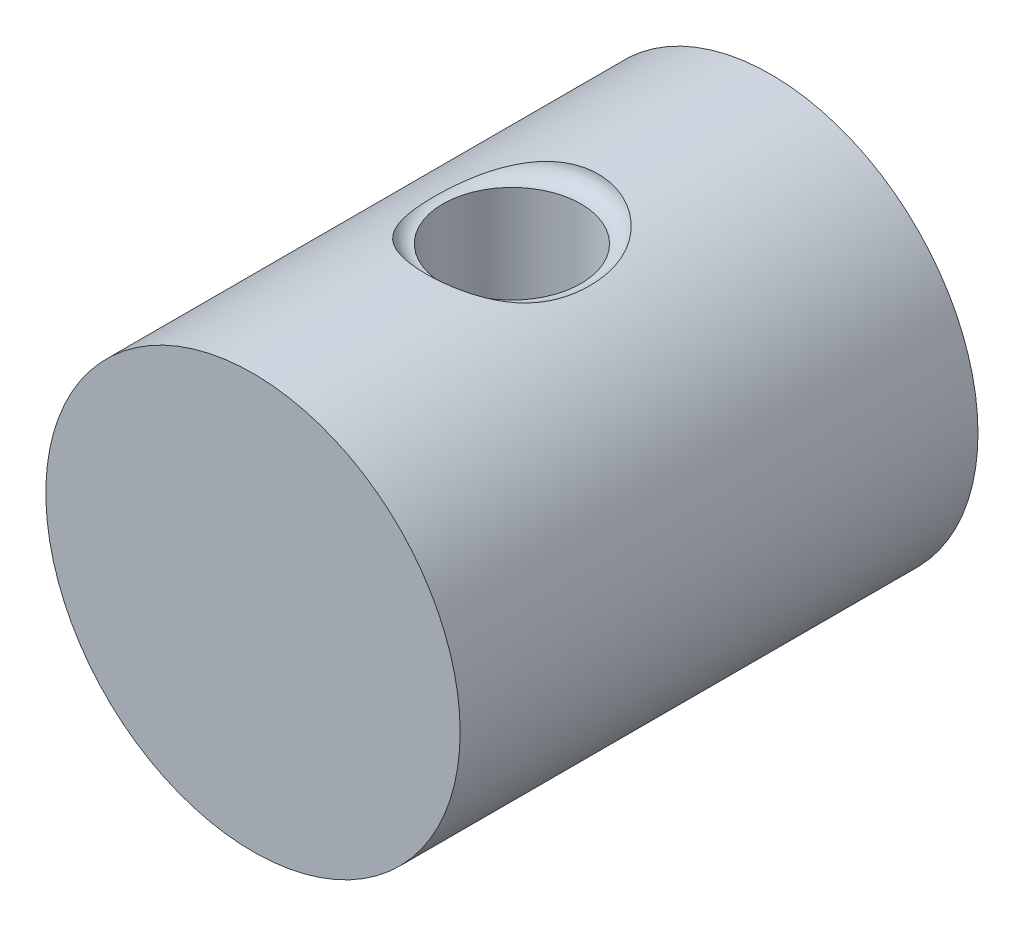
ISO-10303-21;
HEADER;
FILE_DESCRIPTION(('STEP AP214'),'2;1');
FILE_NAME('part.step','',(''),(''),'','','');
FILE_SCHEMA(('AUTOMOTIVE_DESIGN { 1 0 10303 214 1 1 1 1 }'));
ENDSEC;
DATA;
#1=APPLICATION_CONTEXT('core data for automotive mechanical design processes');
#2=APPLICATION_PROTOCOL_DEFINITION('international standard','automotive_design',2000,#1);
#3=PRODUCT_CONTEXT('',#1,'mechanical');
#4=PRODUCT('Part','Part','',(#3));
#5=PRODUCT_RELATED_PRODUCT_CATEGORY('part','',(#4));
#6=PRODUCT_DEFINITION_FORMATION('','',#4);
#7=PRODUCT_DEFINITION_CONTEXT('part definition',#1,'design');
#8=PRODUCT_DEFINITION('design','',#6,#7);
#9=PRODUCT_DEFINITION_SHAPE('','',#8);
#10=(LENGTH_UNIT() NAMED_UNIT(*) SI_UNIT(.MILLI.,.METRE.));
#11=(NAMED_UNIT(*) PLANE_ANGLE_UNIT() SI_UNIT($,.RADIAN.));
#12=(NAMED_UNIT(*) SI_UNIT($,.STERADIAN.) SOLID_ANGLE_UNIT());
#13=UNCERTAINTY_MEASURE_WITH_UNIT(LENGTH_MEASURE(1.E-05),#10,'distance_accuracy_value','');
#14=(GEOMETRIC_REPRESENTATION_CONTEXT(3) GLOBAL_UNCERTAINTY_ASSIGNED_CONTEXT((#13)) GLOBAL_UNIT_ASSIGNED_CONTEXT((#10,
#11,#12)) REPRESENTATION_CONTEXT('',''));
#15=CARTESIAN_POINT('',(0.,0.,0.));
#16=DIRECTION('',(0.,0.,1.));
#17=DIRECTION('',(1.,0.,0.));
#18=AXIS2_PLACEMENT_3D('',#15,#16,#17);
#19=CARTESIAN_POINT('',(0.,0.,15.));
#20=DIRECTION('',(0.,0.,-1.));
#21=DIRECTION('',(-1.,0.,0.));
#22=AXIS2_PLACEMENT_3D('',#19,#20,#21);
#23=CYLINDRICAL_SURFACE('',#22,12.);
#24=CARTESIAN_POINT('',(0.,0.,-15.));
#25=DIRECTION('',(0.,0.,1.));
#26=DIRECTION('',(1.,0.,0.));
#27=AXIS2_PLACEMENT_3D('',#24,#25,#26);
#28=CIRCLE('',#27,12.);
#29=CARTESIAN_POINT('',(12.,0.,-15.));
#30=VERTEX_POINT('',#29);
#31=EDGE_CURVE('E42',#30,#30,#28,.T.);
#32=ORIENTED_EDGE('',*,*,#31,.T.);
#33=EDGE_LOOP('',(#32));
#34=FACE_BOUND('',#33,.T.);
#35=CARTESIAN_POINT('',(0.,0.,15.));
#36=DIRECTION('',(0.,0.,1.));
#37=DIRECTION('',(1.,0.,0.));
#38=AXIS2_PLACEMENT_3D('',#35,#36,#37);
#39=CIRCLE('',#38,12.);
#40=CARTESIAN_POINT('',(12.,0.,15.));
#41=VERTEX_POINT('',#40);
#42=EDGE_CURVE('E38',#41,#41,#39,.T.);
#43=ORIENTED_EDGE('',*,*,#42,.F.);
#44=EDGE_LOOP('',(#43));
#45=FACE_BOUND('',#44,.T.);
#46=CARTESIAN_POINT('',(0.,-12.,3.99999999999999));
#47=CARTESIAN_POINT('',(0.218253451546892,-12.0000006120378,4.00000101492655));
#48=CARTESIAN_POINT('',(0.436500778154198,-11.9939907803018,3.98207893549112));
#49=CARTESIAN_POINT('',(0.866567043491887,-11.9706084081312,3.91108356473112));
#50=CARTESIAN_POINT('',(1.07838531247527,-11.9532346880861,3.8580066242043));
#51=CARTESIAN_POINT('',(1.4893311580071,-11.9090123162577,3.7187230264638));
#52=CARTESIAN_POINT('',(1.68847930354413,-11.8821795092341,3.6325717501629));
#53=CARTESIAN_POINT('',(2.0694997472213,-11.8217778286937,3.42983530864661));
#54=CARTESIAN_POINT('',(2.25136862783482,-11.7882076267112,3.3132441399896));
#55=CARTESIAN_POINT('',(2.59896670008906,-11.7165637777201,3.04869678056497));
#56=CARTESIAN_POINT('',(2.76401480119322,-11.6783822585509,2.89987506295799));
#57=CARTESIAN_POINT('',(3.06733077080835,-11.6024125913254,2.57693138117376));
#58=CARTESIAN_POINT('',(3.2055927419579,-11.5646245316238,2.40280386028606));
#59=CARTESIAN_POINT('',(3.45529976891137,-11.4925332990891,2.02805953921404));
#60=CARTESIAN_POINT('',(3.56585943288389,-11.4583615710204,1.82682504107105));
#61=CARTESIAN_POINT('',(3.75127549551111,-11.3990122167512,1.40729562216627));
#62=CARTESIAN_POINT('',(3.82614278954792,-11.3738318464566,1.18900593135073));
#63=CARTESIAN_POINT('',(3.9354938460358,-11.3364521307493,0.749307114011505));
#64=CARTESIAN_POINT('',(3.97125379308398,-11.3238438306895,0.528251166037676));
#65=CARTESIAN_POINT('',(4.00536449334099,-11.3118262652752,0.082944983382537));
#66=CARTESIAN_POINT('',(4.00372680643039,-11.312412921263,-0.14130424281417));
#67=CARTESIAN_POINT('',(3.96407961480176,-11.3263605999899,-0.575746521807553));
#68=CARTESIAN_POINT('',(3.92773565262441,-11.3391366334693,-0.786113611774476));
#69=CARTESIAN_POINT('',(3.82242465135522,-11.3750663077523,-1.19757367852082));
#70=CARTESIAN_POINT('',(3.75345370635798,-11.3982211910317,-1.39866554176195));
#71=CARTESIAN_POINT('',(3.58375623225406,-11.4527164455868,-1.78965099833565));
#72=CARTESIAN_POINT('',(3.48253619483259,-11.4841826318151,-1.97931210186998));
#73=CARTESIAN_POINT('',(3.251556425209,-11.5517023429386,-2.33948363312703));
#74=CARTESIAN_POINT('',(3.12178844945504,-11.5877571915937,-2.50998850773575));
#75=CARTESIAN_POINT('',(2.82939733072997,-11.6626931667357,-2.83636639264074));
#76=CARTESIAN_POINT('',(2.66541260030551,-11.7016235742007,-2.99101077803564));
#77=CARTESIAN_POINT('',(2.31335827987998,-11.7762775354745,-3.27092506665421));
#78=CARTESIAN_POINT('',(2.12528638264318,-11.8120007815208,-3.39619215265814));
#79=CARTESIAN_POINT('',(1.72779045218514,-11.8766843175137,-3.6147852009401));
#80=CARTESIAN_POINT('',(1.51817310566536,-11.9055740003221,-3.70778196536287));
#81=CARTESIAN_POINT('',(1.08507633345801,-11.9528226857769,-3.85681269582288));
#82=CARTESIAN_POINT('',(0.861601752619807,-11.971185346195,-3.91285950169375));
#83=CARTESIAN_POINT('',(0.41753531811722,-11.9947050828577,-3.98422266408941));
#84=CARTESIAN_POINT('',(0.197238399459386,-12.0004000733492,-4.00119923669099));
#85=CARTESIAN_POINT('',(-0.24310027984095,-11.9995561077931,-3.99866930560612));
#86=CARTESIAN_POINT('',(-0.463142077278601,-11.9930192167745,-3.97916896008049));
#87=CARTESIAN_POINT('',(-0.89007946521702,-11.9688009886842,-3.90555236905616));
#88=CARTESIAN_POINT('',(-1.09717122733937,-11.9514479484477,-3.85245517580201));
#89=CARTESIAN_POINT('',(-1.49942383431829,-11.9076738732028,-3.71442622213308));
#90=CARTESIAN_POINT('',(-1.69458315403442,-11.881251681867,-3.62949040212885));
#91=CARTESIAN_POINT('',(-2.07315318557309,-11.8211572514916,-3.42771827263685));
#92=CARTESIAN_POINT('',(-2.25611983686858,-11.7873125902314,-3.31010162686731));
#93=CARTESIAN_POINT('',(-2.60025932054234,-11.7162101566505,-3.04722339994606));
#94=CARTESIAN_POINT('',(-2.7614254711823,-11.6789513437531,-2.90195337587293));
#95=CARTESIAN_POINT('',(-3.06501003122519,-11.6030739192178,-2.58008499597364));
#96=CARTESIAN_POINT('',(-3.20624387698308,-11.5644704434971,-2.40236309229255));
#97=CARTESIAN_POINT('',(-3.45703008929429,-11.4919989317884,-2.02491372875644));
#98=CARTESIAN_POINT('',(-3.56658219172405,-11.4581309352801,-1.82518608546369));
#99=CARTESIAN_POINT('',(-3.75038772166544,-11.3992956716553,-1.40930793884041));
#100=CARTESIAN_POINT('',(-3.82471252866008,-11.3743104317192,-1.19319168332493));
#101=CARTESIAN_POINT('',(-3.93557866703741,-11.336433292258,-0.750485399823475));
#102=CARTESIAN_POINT('',(-3.97213701981575,-11.3235359449456,-0.5239001383826));
#103=CARTESIAN_POINT('',(-4.00510512990936,-11.3119143549671,-0.0792116158363334));
#104=CARTESIAN_POINT('',(-4.00348102923359,-11.3124960102966,0.138729361147295));
#105=CARTESIAN_POINT('',(-3.96496917379476,-11.3260507929547,0.57106029968825));
#106=CARTESIAN_POINT('',(-3.92808351783433,-11.3390231827745,0.785450471820353));
#107=CARTESIAN_POINT('',(-3.82148725251737,-11.3753809721957,1.20054265200989));
#108=CARTESIAN_POINT('',(-3.75241338406205,-11.3985639208991,1.40142730001798));
#109=CARTESIAN_POINT('',(-3.58391746303898,-11.4526559527387,1.78890962775307));
#110=CARTESIAN_POINT('',(-3.48448867421521,-11.4835667505357,1.97550412475202));
#111=CARTESIAN_POINT('',(-3.25304277033371,-11.5513131690419,2.33793467969164));
#112=CARTESIAN_POINT('',(-3.11979297105831,-11.5883484656855,2.51294600759354));
#113=CARTESIAN_POINT('',(-2.82657153254259,-11.6633342513301,2.8387592535368));
#114=CARTESIAN_POINT('',(-2.66659233780592,-11.7012849964949,2.98955430275229));
#115=CARTESIAN_POINT('',(-2.31696622768275,-11.7756012210218,3.26857764915671));
#116=CARTESIAN_POINT('',(-2.12640605399891,-11.8118472720503,3.39569739100399));
#117=CARTESIAN_POINT('',(-1.72542942962649,-11.8770396469045,3.61596171540258));
#118=CARTESIAN_POINT('',(-1.51501807252939,-11.9059878363172,3.70911498368816));
#119=CARTESIAN_POINT('',(-1.0899745888039,-11.9522206027417,3.85488652995468));
#120=CARTESIAN_POINT('',(-0.875951030705631,-11.9699684969009,3.9091298650535));
#121=CARTESIAN_POINT('',(-0.441281664040986,-11.9938562825689,3.9816811227085));
#122=CARTESIAN_POINT('',(-0.220637702274985,-11.9999993812762,3.99999897398614));
#123=CARTESIAN_POINT('',(0.,-12.,3.99999999999999));
#124=B_SPLINE_CURVE_WITH_KNOTS('',3,(#46,#47,#48,#49,#50,#51,#52,#53,#54,#55,#56,#57,#58,#59,
#60,#61,#62,#63,#64,#65,#66,#67,#68,#69,#70,#71,#72,#73,#74,#75,#76,#77,#78,#79,#80,#81,#82,#83,
#84,#85,#86,#87,#88,#89,#90,#91,#92,#93,#94,#95,#96,#97,#98,#99,#100,#101,#102,#103,#104,#105,
#106,#107,#108,#109,#110,#111,#112,#113,#114,#115,#116,#117,#118,#119,#120,#121,#122,#123),
.UNSPECIFIED.,.T.,.F.,(4,2,2,2,2,2,2,2,2,2,2,2,2,2,2,2,2,2,2,2,2,2,2,2,2,2,2,2,2,2,2,2,2,2,2,2,
2,2,4),(0.,0.653948424104042,1.30796474107008,1.96089069148109,2.61394551119639,
3.28738737131023,3.9609773315012,4.65393539293881,5.34668178771332,6.01607702967359,
6.6852653594994,7.32387306208102,7.9625572342758,8.61152684626174,9.26068410238481,
9.94373223251119,10.6268458387212,11.3167362260708,12.0063867551448,12.6661433270633,
13.3257885266236,13.966326319185,14.6069458114207,15.264415993806,15.9220872329322,
16.6096409152866,17.2972003294564,17.9833605531273,18.6692113882901,19.3198266426268,
19.9704031741115,20.6086234832732,21.2469855270956,21.9132026677287,22.5796084450076,
23.2719864334605,23.9641872461547,24.625462335009,25.2865546415821),.UNSPECIFIED.);
#125=CARTESIAN_POINT('',(0.,-12.,3.99999999999999));
#126=VERTEX_POINT('',#125);
#127=EDGE_CURVE('E10',#126,#126,#124,.T.);
#128=ORIENTED_EDGE('',*,*,#127,.T.);
#129=EDGE_LOOP('',(#128));
#130=FACE_BOUND('',#129,.T.);
#131=CARTESIAN_POINT('',(-3.90625407215167,11.3464170169829,-2.71456208547322));
#132=CARTESIAN_POINT('',(-3.96696758565541,11.3255154258224,-2.59556288274317));
#133=CARTESIAN_POINT('',(-4.02245907180115,11.305869630917,-2.47362055563177));
#134=CARTESIAN_POINT('',(-4.12322082527967,11.2695129577877,-2.22511182652662));
#135=CARTESIAN_POINT('',(-4.16848353462863,11.2528042517738,-2.09854208506624));
#136=CARTESIAN_POINT('',(-4.2494312224976,11.2224868740092,-1.84139264663619));
#137=CARTESIAN_POINT('',(-4.28507224792735,11.2088924701685,-1.71079748609996));
#138=CARTESIAN_POINT('',(-4.34716309723382,11.1849574210389,-1.4471903509623));
#139=CARTESIAN_POINT('',(-4.3736136529028,11.1746165166959,-1.31417856967248));
#140=CARTESIAN_POINT('',(-4.42714724684082,11.1535432607664,-0.991942312512819));
#141=CARTESIAN_POINT('',(-4.45008581893379,11.1443723772172,-0.801923366287533));
#142=CARTESIAN_POINT('',(-4.48103840904798,11.1319608038804,-0.420418439655755));
#143=CARTESIAN_POINT('',(-4.48904234150744,11.1287241215638,-0.22893155549469));
#144=CARTESIAN_POINT('',(-4.49090040797323,11.12797438062,0.154043012473006));
#145=CARTESIAN_POINT('',(-4.48476020588554,11.1304590309306,0.345530665264502));
#146=CARTESIAN_POINT('',(-4.45772244676556,11.1413169194291,0.727236990982739));
#147=CARTESIAN_POINT('',(-4.43683377147773,11.1496866135457,0.917456358129395));
#148=CARTESIAN_POINT('',(-4.38666546272879,11.1694968523207,1.24271059909068));
#149=CARTESIAN_POINT('',(-4.3613097170413,11.1794457988782,1.37844421520173));
#150=CARTESIAN_POINT('',(-4.30120965763468,11.2027068699157,1.64753762343231));
#151=CARTESIAN_POINT('',(-4.26646647699795,11.2160185884896,1.78089769997356));
#152=CARTESIAN_POINT('',(-4.18696277156962,11.2459388941889,2.04390318637351));
#153=CARTESIAN_POINT('',(-4.14222550318772,11.2625398172989,2.17355644446186));
#154=CARTESIAN_POINT('',(-4.0421342090718,11.2988487947188,2.42827486002024));
#155=CARTESIAN_POINT('',(-3.98678006021897,11.3185568850605,2.55333996426365));
#156=CARTESIAN_POINT('',(-3.86449635857225,11.3608932626187,2.79889103485492));
#157=CARTESIAN_POINT('',(-3.79744962638745,11.3835504578193,2.91931392291231));
#158=CARTESIAN_POINT('',(-3.65217765531633,11.4309855525648,3.15279617086307));
#159=CARTESIAN_POINT('',(-3.57395219061521,11.4557634949457,3.2658553819401));
#160=CARTESIAN_POINT('',(-3.40660605769262,11.506636347814,3.48335579428468));
#161=CARTESIAN_POINT('',(-3.31748162795376,11.532731711143,3.58779399926992));
#162=CARTESIAN_POINT('',(-3.12898829330785,11.5852921136826,3.78686248040181));
#163=CARTESIAN_POINT('',(-3.02962081317005,11.6117571010384,3.88149411694259));
#164=CARTESIAN_POINT('',(-2.83673600047478,11.6602454408862,4.04700772209302));
#165=CARTESIAN_POINT('',(-2.74447941642603,11.682353604786,4.11934051698528));
#166=CARTESIAN_POINT('',(-2.5538025047529,11.7255127799554,4.25579756952907));
#167=CARTESIAN_POINT('',(-2.45538019334434,11.7465634470158,4.31991916486853));
#168=CARTESIAN_POINT('',(-2.25322426975828,11.7870092530761,4.43959601916291));
#169=CARTESIAN_POINT('',(-2.14949421150975,11.8064054772294,4.49515691269387));
#170=CARTESIAN_POINT('',(-1.93746226028587,11.8430508976405,4.59761761489886));
#171=CARTESIAN_POINT('',(-1.82915862605353,11.8602992661135,4.64451408764781));
#172=CARTESIAN_POINT('',(-1.50144137751724,11.9077175825581,4.7709868913483));
#173=CARTESIAN_POINT('',(-1.27646345793076,11.9341283115206,4.83795570506434));
#174=CARTESIAN_POINT('',(-0.818107617613478,11.9742963987718,4.93807745628505));
#175=CARTESIAN_POINT('',(-0.58472611304853,11.9880482904792,4.97121578513514));
#176=CARTESIAN_POINT('',(-0.0990176385759486,12.0022153648856,5.00537115146897));
#177=CARTESIAN_POINT('',(0.153506740202589,12.0016463390759,5.00401765440923));
#178=CARTESIAN_POINT('',(0.655121634224389,11.984727294913,4.96318815845357));
#179=CARTESIAN_POINT('',(0.904211468732464,11.9683741924548,4.92370470921438));
#180=CARTESIAN_POINT('',(1.27262276003526,11.9329925557805,4.83479112247371));
#181=CARTESIAN_POINT('',(1.39603890945473,11.9191497105997,4.79958047274032));
#182=CARTESIAN_POINT('',(1.63904611931739,11.8881655287888,4.71894229033676));
#183=CARTESIAN_POINT('',(1.75863871544692,11.8710255363325,4.67351891989696));
#184=CARTESIAN_POINT('',(1.99293980750064,11.8339456422642,4.57248203125136));
#185=CARTESIAN_POINT('',(2.10764983074862,11.8140066247327,4.51687172893419));
#186=CARTESIAN_POINT('',(2.33119784586195,11.7719347663793,4.39558576148166));
#187=CARTESIAN_POINT('',(2.44003627121513,11.7498020878542,4.32991084077481));
#188=CARTESIAN_POINT('',(2.64446008474524,11.7054305606746,4.19307183705118));
#189=CARTESIAN_POINT('',(2.74044891202709,11.6832793782955,4.12248135351648));
#190=CARTESIAN_POINT('',(2.92562126199773,11.6382910831325,3.97307722846362));
#191=CARTESIAN_POINT('',(3.01480516246481,11.6154540085245,3.89426404400795));
#192=CARTESIAN_POINT('',(3.18570252509378,11.5697504204806,3.72897926562746));
#193=CARTESIAN_POINT('',(3.26741826929218,11.5468839182173,3.64251002716279));
#194=CARTESIAN_POINT('',(3.42291154774723,11.5017491636192,3.46256682067552));
#195=CARTESIAN_POINT('',(3.49668915254738,11.4794809059693,3.36909291491349));
#196=CARTESIAN_POINT('',(3.63319065029125,11.4369940029595,3.17978685698656));
#197=CARTESIAN_POINT('',(3.69623834538596,11.4167290181116,3.08419801680311));
#198=CARTESIAN_POINT('',(3.8145743442425,11.3777372564606,2.88804918291692));
#199=CARTESIAN_POINT('',(3.86986306335731,11.3590103973409,2.78748945570537));
#200=CARTESIAN_POINT('',(3.97269784014263,11.3234550434851,2.58218818754536));
#201=CARTESIAN_POINT('',(4.02024482179463,11.3066263222788,2.47744714750011));
#202=CARTESIAN_POINT('',(4.10777926107373,11.2751190600195,2.26453062368442));
#203=CARTESIAN_POINT('',(4.14776504452511,11.2604409953195,2.15635438548183));
#204=CARTESIAN_POINT('',(4.23529068433287,11.2278813401979,1.89260995445846));
#205=CARTESIAN_POINT('',(4.2792590241551,11.2111351655733,1.73570903029103));
#206=CARTESIAN_POINT('',(4.35390150031205,11.1823580716804,1.41834783753059));
#207=CARTESIAN_POINT('',(4.3845698520296,11.1703292043467,1.25788605202766));
#208=CARTESIAN_POINT('',(4.43397677595626,11.1508095512548,0.934281937350757));
#209=CARTESIAN_POINT('',(4.45267047951953,11.1433358385379,0.771131849088207));
#210=CARTESIAN_POINT('',(4.47905000857428,11.1327582787649,0.443834376985833));
#211=CARTESIAN_POINT('',(4.48673616627219,11.1296542998308,0.279687023393513));
#212=CARTESIAN_POINT('',(4.49174679526533,11.1276331308965,-0.0546138640832292));
#213=CARTESIAN_POINT('',(4.48869413478296,11.1288683242656,-0.224773954779847));
#214=CARTESIAN_POINT('',(4.47114128304122,11.1359323549743,-0.564440513687656));
#215=CARTESIAN_POINT('',(4.45664005278837,11.1417616092393,-0.733946921171962));
#216=CARTESIAN_POINT('',(4.4152395047767,11.1582328545338,-1.07066880682619));
#217=CARTESIAN_POINT('',(4.38838112259235,11.1688589528715,-1.23788998635502));
#218=CARTESIAN_POINT('',(4.32088448728771,11.195145441189,-1.56911802404632));
#219=CARTESIAN_POINT('',(4.28025244875562,11.2108035605869,-1.73312629661271));
#220=CARTESIAN_POINT('',(4.19636945890991,11.2424160873831,-2.01419065052905));
#221=CARTESIAN_POINT('',(4.15652865491459,11.2572411873622,-2.13239552964842));
#222=CARTESIAN_POINT('',(4.06813180667377,11.2894871849911,-2.36512523429427));
#223=CARTESIAN_POINT('',(4.01957798699071,11.3069074198718,-2.47965099037639));
#224=CARTESIAN_POINT('',(3.91349644773503,11.3440601094693,-2.70405056892344));
#225=CARTESIAN_POINT('',(3.85597132858207,11.3637918937495,-2.8139257277129));
#226=CARTESIAN_POINT('',(3.731861292092,11.4051517823118,-3.02807503988065));
#227=CARTESIAN_POINT('',(3.66527624813084,11.4267799130963,-3.13234911494819));
#228=CARTESIAN_POINT('',(3.52281414792724,11.4715029169613,-3.33485517842127));
#229=CARTESIAN_POINT('',(3.4468907453388,11.494604807484,-3.43305307059704));
#230=CARTESIAN_POINT('',(3.28637940788852,11.5415205838584,-3.62191690050722));
#231=CARTESIAN_POINT('',(3.20179136453872,11.5653344786221,-3.71258274390885));
#232=CARTESIAN_POINT('',(3.02448911726695,11.6129620800226,-3.88562129077659));
#233=CARTESIAN_POINT('',(2.93177353784569,11.6367757859426,-3.96799258539008));
#234=CARTESIAN_POINT('',(2.73895488968338,11.6836624411377,-4.12380467449429));
#235=CARTESIAN_POINT('',(2.63885219482981,11.7067354278185,-4.19724592046821));
#236=CARTESIAN_POINT('',(2.44003158169245,11.7497137250366,-4.32948506639597));
#237=CARTESIAN_POINT('',(2.34179574077593,11.7697262765082,-4.38897391816191));
#238=CARTESIAN_POINT('',(2.14047044259921,11.8080024072536,-4.49976015384108));
#239=CARTESIAN_POINT('',(2.03737933700228,11.8262653860788,-4.55105472950344));
#240=CARTESIAN_POINT('',(1.72202790353166,11.8776995403077,-4.6923955813052));
#241=CARTESIAN_POINT('',(1.50350062729173,11.9075580294397,-4.7700233020967));
#242=CARTESIAN_POINT('',(1.04941321980868,11.9562783401711,-4.89382202517191));
#243=CARTESIAN_POINT('',(0.813535743426058,11.9747730066761,-4.93895014490692));
#244=CARTESIAN_POINT('',(0.336845734545922,11.9976407714561,-4.99446906897325));
#245=CARTESIAN_POINT('',(0.096030772966469,12.0020067425539,-5.00484234142138));
#246=CARTESIAN_POINT('',(-0.272160442211135,11.9976031670861,-4.9942325153709));
#247=CARTESIAN_POINT('',(-0.400098225217314,11.9940072053311,-4.98561013618906));
#248=CARTESIAN_POINT('',(-0.654729402830158,11.9828011457954,-4.95846595762694));
#249=CARTESIAN_POINT('',(-0.781423228358746,11.9751924919065,-4.93994771905359));
#250=CARTESIAN_POINT('',(-1.03268217866472,11.956147244498,-4.8929279974408));
#251=CARTESIAN_POINT('',(-1.15724676219598,11.9447096924585,-4.8644240145035));
#252=CARTESIAN_POINT('',(-1.40320770658905,11.9183176284935,-4.79736552737369));
#253=CARTESIAN_POINT('',(-1.52460546338522,11.9033646962749,-4.75881553671518));
#254=CARTESIAN_POINT('',(-1.7623522828124,11.8704845847786,-4.67196020036432));
#255=CARTESIAN_POINT('',(-1.87873348395228,11.8525816616005,-4.62373376721289));
#256=CARTESIAN_POINT('',(-2.10640696429213,11.8142443953652,-4.51740988235147));
#257=CARTESIAN_POINT('',(-2.21770140585139,11.7938111419039,-4.45931667543712));
#258=CARTESIAN_POINT('',(-2.43428200168879,11.7510195089328,-4.33341536073172));
#259=CARTESIAN_POINT('',(-2.5395675878845,11.7286609479023,-4.26560633651926));
#260=CARTESIAN_POINT('',(-2.74318196135307,11.6827157139104,-4.12061949254922));
#261=CARTESIAN_POINT('',(-2.84151146405804,11.6591291676815,-4.04344263849536));
#262=CARTESIAN_POINT('',(-3.02394932076672,11.6130948998327,-3.88580491443943));
#263=CARTESIAN_POINT('',(-3.10857018963253,11.5906791828061,-3.8059267547434));
#264=CARTESIAN_POINT('',(-3.27050792927097,11.5460310923933,-3.63903727559885));
#265=CARTESIAN_POINT('',(-3.34782505455705,11.5237987126432,-3.55202620490828));
#266=CARTESIAN_POINT('',(-3.4946101683835,11.4801374771529,-3.3717022514298));
#267=CARTESIAN_POINT('',(-3.56409146838007,11.4587073013203,-3.27840049971433));
#268=CARTESIAN_POINT('',(-3.69507983359109,11.4171409236144,-3.08614630884715));
#269=CARTESIAN_POINT('',(-3.75659118449648,11.3970040292659,-2.98719694817508));
#270=CARTESIAN_POINT('',(-3.83005935933341,11.3723756899962,-2.85765411738634));
#271=CARTESIAN_POINT('',(-3.84573571225146,11.3670832041015,-2.82927694225106));
#272=CARTESIAN_POINT('',(-3.8764618214649,11.3566415182041,-2.77217826060226));
#273=CARTESIAN_POINT('',(-3.89151189051173,11.3514922471198,-2.7434569354072));
#274=CARTESIAN_POINT('',(-3.90625407215167,11.3464170169829,-2.71456208547322));
#275=B_SPLINE_CURVE_WITH_KNOTS('',3,(#131,#132,#133,#134,#135,#136,#137,#138,#139,#140,#141,
#142,#143,#144,#145,#146,#147,#148,#149,#150,#151,#152,#153,#154,#155,#156,#157,#158,#159,#160,
#161,#162,#163,#164,#165,#166,#167,#168,#169,#170,#171,#172,#173,#174,#175,#176,#177,#178,#179,
#180,#181,#182,#183,#184,#185,#186,#187,#188,#189,#190,#191,#192,#193,#194,#195,#196,#197,#198,
#199,#200,#201,#202,#203,#204,#205,#206,#207,#208,#209,#210,#211,#212,#213,#214,#215,#216,#217,
#218,#219,#220,#221,#222,#223,#224,#225,#226,#227,#228,#229,#230,#231,#232,#233,#234,#235,#236,
#237,#238,#239,#240,#241,#242,#243,#244,#245,#246,#247,#248,#249,#250,#251,#252,#253,#254,#255,
#256,#257,#258,#259,#260,#261,#262,#263,#264,#265,#266,#267,#268,#269,#270,#271,#272,#273,#274),
.UNSPECIFIED.,.T.,.F.,(4,2,2,2,2,2,2,2,2,2,2,2,2,2,2,2,2,2,2,2,2,2,2,2,2,2,2,2,2,2,2,2,2,2,2,2,
2,2,2,2,2,2,2,2,2,2,2,2,2,2,2,2,2,2,2,2,2,2,2,2,2,2,2,2,2,2,2,2,2,2,2,4),(0.,0.405619570269155,
0.811537877610909,1.21928024525099,1.62699013891202,2.20103503935447,2.77546745988479,
3.3496698935195,3.92352682873482,4.3385166698614,4.75345644323319,5.16744052081827,
5.58142939946601,5.99983441787224,6.41824788941929,6.83680617609582,7.25530632127029,
7.61276414337671,7.97033757193291,8.32767463417591,8.6851489908585,9.39048719600718,
10.0961298511024,10.8503924961309,11.6048025489719,11.9916403712403,12.378320821255,
12.7648794107366,13.1514094222375,13.5145222024698,13.8776148096592,14.2405960934522,
14.6035741512898,14.9520543590255,15.3005159048198,15.6489358309635,15.9974328130043,
16.4880802104804,16.9789407936978,17.4716300213139,17.9643043793142,18.4744508543183,
18.9846436320317,19.4931583286376,20.0014438912838,20.3779501556796,20.7543604288421,
21.1306617978682,21.5069684267283,21.8852243396269,22.2634849891594,22.6418097793449,
23.0201154343195,23.3694213897971,23.7188467998833,24.417016065589,25.1366961664902,
25.8567392512709,26.2412001338089,26.6255227696295,27.0099416881786,27.3941881894407,
27.7754199334933,28.1564880809357,28.5375921954173,28.918657056241,29.273739575409,
29.6288097164538,29.9832672789899,30.3375334405043,30.4360739702167,30.5345646856528),.UNSPECIFIED.);
#276=CARTESIAN_POINT('',(-3.90625407215167,11.3464170169829,-2.71456208547322));
#277=VERTEX_POINT('',#276);
#278=EDGE_CURVE('E77',#277,#277,#275,.T.);
#279=ORIENTED_EDGE('',*,*,#278,.F.);
#280=EDGE_LOOP('',(#279));
#281=FACE_BOUND('',#280,.T.);
#282=ADVANCED_FACE('F30',(#34,#45,#130,#281),#23,.T.);
#283=CARTESIAN_POINT('',(0.,12.,0.));
#284=DIRECTION('',(0.,1.,0.));
#285=DIRECTION('',(0.,0.,1.));
#286=AXIS2_PLACEMENT_3D('',#283,#284,#285);
#287=CYLINDRICAL_SURFACE('',#286,3.99999999999999);
#288=ORIENTED_EDGE('',*,*,#127,.F.);
#289=EDGE_LOOP('',(#288));
#290=FACE_BOUND('',#289,.T.);
#291=CARTESIAN_POINT('',(0.,11.,0.));
#292=DIRECTION('',(0.,1.,0.));
#293=DIRECTION('',(0.,0.,1.));
#294=AXIS2_PLACEMENT_3D('',#291,#292,#293);
#295=CIRCLE('',#294,3.99999999999999);
#296=CARTESIAN_POINT('',(0.,11.,3.99999999999999));
#297=VERTEX_POINT('',#296);
#298=EDGE_CURVE('E34',#297,#297,#295,.F.);
#299=ORIENTED_EDGE('',*,*,#298,.F.);
#300=EDGE_LOOP('',(#299));
#301=FACE_BOUND('',#300,.T.);
#302=ADVANCED_FACE('F48',(#290,#301),#287,.F.);
#303=CARTESIAN_POINT('',(0.,0.,15.));
#304=DIRECTION('',(0.,0.,1.));
#305=DIRECTION('',(1.,0.,0.));
#306=AXIS2_PLACEMENT_3D('',#303,#304,#305);
#307=PLANE('',#306);
#308=ORIENTED_EDGE('',*,*,#42,.T.);
#309=EDGE_LOOP('',(#308));
#310=FACE_BOUND('',#309,.T.);
#311=ADVANCED_FACE('F53',(#310),#307,.T.);
#312=CARTESIAN_POINT('',(0.,0.,-15.));
#313=DIRECTION('',(0.,0.,1.));
#314=DIRECTION('',(1.,0.,0.));
#315=AXIS2_PLACEMENT_3D('',#312,#313,#314);
#316=PLANE('',#315);
#317=ORIENTED_EDGE('',*,*,#31,.F.);
#318=EDGE_LOOP('',(#317));
#319=FACE_BOUND('',#318,.T.);
#320=ADVANCED_FACE('F58',(#319),#316,.F.);
#321=CARTESIAN_POINT('',(0.,12.,0.));
#322=DIRECTION('',(0.,-1.,0.));
#323=DIRECTION('',(0.,0.,-1.));
#324=AXIS2_PLACEMENT_3D('',#321,#322,#323);
#325=TOROIDAL_SURFACE('',#324,3.99999999999999,1.);
#326=ORIENTED_EDGE('',*,*,#298,.T.);
#327=EDGE_LOOP('',(#326));
#328=FACE_BOUND('',#327,.T.);
#329=ORIENTED_EDGE('',*,*,#278,.T.);
#330=EDGE_LOOP('',(#329));
#331=FACE_BOUND('',#330,.T.);
#332=ADVANCED_FACE('F55',(#328,#331),#325,.F.);
#333=CLOSED_SHELL('',(#282,#302,#311,#320,#332));
#334=MANIFOLD_SOLID_BREP('B2',#333);
#335=ADVANCED_BREP_SHAPE_REPRESENTATION('',(#18,#334),#14);
#336=SHAPE_DEFINITION_REPRESENTATION(#9,#335);
ENDSEC;
END-ISO-10303-21;
